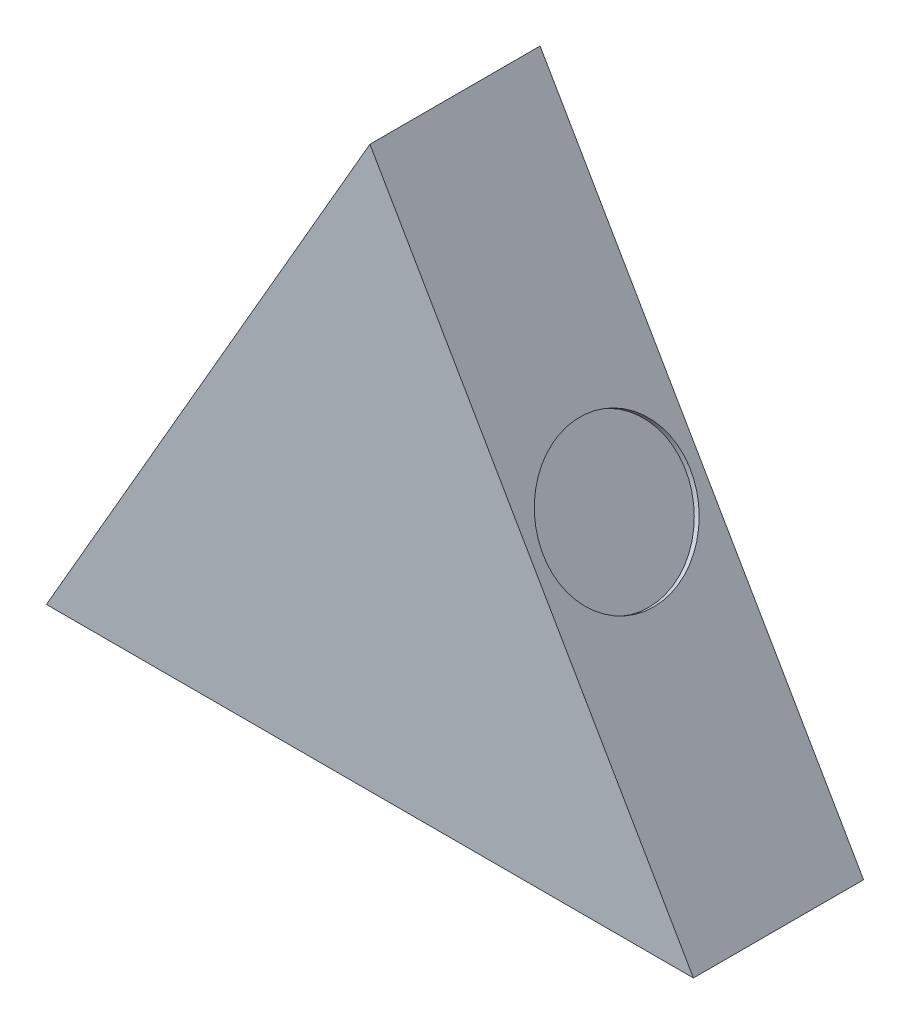
ISO-10303-21;
HEADER;
FILE_DESCRIPTION(('STEP AP214'),'2;1');
FILE_NAME('part.step','',(''),(''),'','','');
FILE_SCHEMA(('AUTOMOTIVE_DESIGN { 1 0 10303 214 1 1 1 1 }'));
ENDSEC;
DATA;
#1=APPLICATION_CONTEXT('core data for automotive mechanical design processes');
#2=APPLICATION_PROTOCOL_DEFINITION('international standard','automotive_design',2000,#1);
#3=PRODUCT_CONTEXT('',#1,'mechanical');
#4=PRODUCT('Part','Part','',(#3));
#5=PRODUCT_RELATED_PRODUCT_CATEGORY('part','',(#4));
#6=PRODUCT_DEFINITION_FORMATION('','',#4);
#7=PRODUCT_DEFINITION_CONTEXT('part definition',#1,'design');
#8=PRODUCT_DEFINITION('design','',#6,#7);
#9=PRODUCT_DEFINITION_SHAPE('','',#8);
#10=(LENGTH_UNIT() NAMED_UNIT(*) SI_UNIT(.MILLI.,.METRE.));
#11=(NAMED_UNIT(*) PLANE_ANGLE_UNIT() SI_UNIT($,.RADIAN.));
#12=(NAMED_UNIT(*) SI_UNIT($,.STERADIAN.) SOLID_ANGLE_UNIT());
#13=UNCERTAINTY_MEASURE_WITH_UNIT(LENGTH_MEASURE(1.E-05),#10,'distance_accuracy_value','');
#14=(GEOMETRIC_REPRESENTATION_CONTEXT(3) GLOBAL_UNCERTAINTY_ASSIGNED_CONTEXT((#13)) GLOBAL_UNIT_ASSIGNED_CONTEXT((#10,
#11,#12)) REPRESENTATION_CONTEXT('',''));
#15=CARTESIAN_POINT('',(0.,0.,0.));
#16=DIRECTION('',(0.,0.,1.));
#17=DIRECTION('',(1.,0.,0.));
#18=AXIS2_PLACEMENT_3D('',#15,#16,#17);
#19=CARTESIAN_POINT('',(0.,0.,0.));
#20=DIRECTION('',(0.,0.,1.));
#21=DIRECTION('',(1.,0.,0.));
#22=AXIS2_PLACEMENT_3D('',#19,#20,#21);
#23=PLANE('',#22);
#24=DIRECTION('',(-0.500000000000001,0.866025403784438,0.));
#25=VECTOR('',#24,1.);
#26=CARTESIAN_POINT('',(28.5177788775064,-24.6971209674279,0.));
#27=LINE('',#26,#25);
#28=CARTESIAN_POINT('',(28.5177788775064,-24.6971209674279,0.));
#29=VERTEX_POINT('',#28);
#30=CARTESIAN_POINT('',(-2.48065457064683E-13,24.6971209674279,0.));
#31=VERTEX_POINT('',#30);
#32=EDGE_CURVE('E172',#29,#31,#27,.T.);
#33=ORIENTED_EDGE('',*,*,#32,.F.);
#34=DIRECTION('',(1.,0.,0.));
#35=VECTOR('',#34,1.);
#36=CARTESIAN_POINT('',(-28.5177788775064,-24.6971209674279,0.));
#37=LINE('',#36,#35);
#38=CARTESIAN_POINT('',(-28.5177788775064,-24.6971209674279,0.));
#39=VERTEX_POINT('',#38);
#40=EDGE_CURVE('E85',#39,#29,#37,.T.);
#41=ORIENTED_EDGE('',*,*,#40,.F.);
#42=DIRECTION('',(-0.499999999999995,-0.866025403784442,0.));
#43=VECTOR('',#42,1.);
#44=CARTESIAN_POINT('',(-2.48065457064683E-13,24.6971209674279,0.));
#45=LINE('',#44,#43);
#46=EDGE_CURVE('E178',#31,#39,#45,.T.);
#47=ORIENTED_EDGE('',*,*,#46,.F.);
#48=EDGE_LOOP('',(#33,#41,#47));
#49=FACE_BOUND('',#48,.T.);
#50=CARTESIAN_POINT('',(0.,6.58100089794191,0.));
#51=DIRECTION('',(0.,0.,1.));
#52=DIRECTION('',(1.,0.,0.));
#53=AXIS2_PLACEMENT_3D('',#50,#51,#52);
#54=CIRCLE('',#53,3.92145220783505);
#55=CARTESIAN_POINT('',(2.37631234562467,9.70044428649156,0.));
#56=VERTEX_POINT('',#55);
#57=CARTESIAN_POINT('',(-2.37631234562468,9.70044428649156,0.));
#58=VERTEX_POINT('',#57);
#59=EDGE_CURVE('E59',#56,#58,#54,.T.);
#60=ORIENTED_EDGE('',*,*,#59,.T.);
#61=DIRECTION('',(-0.976410228367284,-0.215923750291041,0.));
#62=VECTOR('',#61,1.);
#63=CARTESIAN_POINT('',(-2.37631234562468,9.70044428649156,0.));
#64=LINE('',#63,#62);
#65=CARTESIAN_POINT('',(-3.41776144469771,9.47013781419549,0.));
#66=VERTEX_POINT('',#65);
#67=EDGE_CURVE('E170',#58,#66,#64,.T.);
#68=ORIENTED_EDGE('',*,*,#67,.T.);
#69=CARTESIAN_POINT('',(0.,-3.56299926426535,0.));
#70=DIRECTION('',(0.,0.,1.));
#71=DIRECTION('',(1.,0.,0.));
#72=AXIS2_PLACEMENT_3D('',#69,#70,#71);
#73=CIRCLE('',#72,13.4738174026077);
#74=CARTESIAN_POINT('',(-13.4738174026077,-3.56299926426536,0.));
#75=VERTEX_POINT('',#74);
#76=EDGE_CURVE('E278',#66,#75,#73,.T.);
#77=ORIENTED_EDGE('',*,*,#76,.T.);
#78=DIRECTION('',(0.,-1.,0.));
#79=VECTOR('',#78,1.);
#80=CARTESIAN_POINT('',(-13.4738174026077,-3.56299926426536,0.));
#81=LINE('',#80,#79);
#82=CARTESIAN_POINT('',(-13.4738174026077,-20.0629992642654,0.));
#83=VERTEX_POINT('',#82);
#84=EDGE_CURVE('E282',#75,#83,#81,.T.);
#85=ORIENTED_EDGE('',*,*,#84,.T.);
#86=CARTESIAN_POINT('',(-10.,-20.0629992642654,0.));
#87=DIRECTION('',(0.,0.,1.));
#88=DIRECTION('',(1.,0.,0.));
#89=AXIS2_PLACEMENT_3D('',#86,#87,#88);
#90=CIRCLE('',#89,3.47381740260768);
#91=CARTESIAN_POINT('',(-10.,-23.5368166668731,0.));
#92=VERTEX_POINT('',#91);
#93=EDGE_CURVE('E286',#83,#92,#90,.T.);
#94=ORIENTED_EDGE('',*,*,#93,.T.);
#95=DIRECTION('',(1.,0.,0.));
#96=VECTOR('',#95,1.);
#97=CARTESIAN_POINT('',(-10.,-23.5368166668731,0.));
#98=LINE('',#97,#96);
#99=CARTESIAN_POINT('',(10.,-23.536816666873,0.));
#100=VERTEX_POINT('',#99);
#101=EDGE_CURVE('E290',#92,#100,#98,.T.);
#102=ORIENTED_EDGE('',*,*,#101,.T.);
#103=CARTESIAN_POINT('',(10.,-20.0629992642654,0.));
#104=DIRECTION('',(0.,0.,1.));
#105=DIRECTION('',(1.,0.,0.));
#106=AXIS2_PLACEMENT_3D('',#103,#104,#105);
#107=CIRCLE('',#106,3.47381740260768);
#108=CARTESIAN_POINT('',(13.4738174026077,-20.0629992642654,0.));
#109=VERTEX_POINT('',#108);
#110=EDGE_CURVE('E294',#100,#109,#107,.T.);
#111=ORIENTED_EDGE('',*,*,#110,.T.);
#112=DIRECTION('',(0.,1.,0.));
#113=VECTOR('',#112,1.);
#114=CARTESIAN_POINT('',(13.4738174026077,-3.56299926426536,0.));
#115=LINE('',#114,#113);
#116=CARTESIAN_POINT('',(13.4738174026077,-3.56299926426535,0.));
#117=VERTEX_POINT('',#116);
#118=EDGE_CURVE('E298',#109,#117,#115,.T.);
#119=ORIENTED_EDGE('',*,*,#118,.T.);
#120=CARTESIAN_POINT('',(0.,-3.56299926426535,0.));
#121=DIRECTION('',(0.,0.,1.));
#122=DIRECTION('',(1.,0.,0.));
#123=AXIS2_PLACEMENT_3D('',#120,#121,#122);
#124=CIRCLE('',#123,13.4738174026077);
#125=CARTESIAN_POINT('',(3.41776144469768,9.4701378141955,0.));
#126=VERTEX_POINT('',#125);
#127=EDGE_CURVE('E302',#117,#126,#124,.T.);
#128=ORIENTED_EDGE('',*,*,#127,.T.);
#129=DIRECTION('',(-0.976410228367284,0.215923750291041,0.));
#130=VECTOR('',#129,1.);
#131=CARTESIAN_POINT('',(2.37631234562467,9.70044428649157,0.));
#132=LINE('',#131,#130);
#133=EDGE_CURVE('E166',#126,#56,#132,.T.);
#134=ORIENTED_EDGE('',*,*,#133,.T.);
#135=EDGE_LOOP('',(#60,#68,#77,#85,#94,#102,#111,#119,#128,#134));
#136=FACE_BOUND('',#135,.T.);
#137=ADVANCED_FACE('F43',(#49,#136),#23,.F.);
#138=CARTESIAN_POINT('',(28.5177788775064,-24.6971209674279,15.));
#139=DIRECTION('',(-0.866025403784438,-0.500000000000001,0.));
#140=DIRECTION('',(0.500000000000001,-0.866025403784438,0.));
#141=AXIS2_PLACEMENT_3D('',#138,#139,#140);
#142=PLANE('',#141);
#143=CARTESIAN_POINT('',(14.2588894387531,-1.5292080969564E-13,7.5));
#144=DIRECTION('',(-0.866025403784438,-0.500000000000001,0.));
#145=DIRECTION('',(0.500000000000001,-0.866025403784438,0.));
#146=AXIS2_PLACEMENT_3D('',#143,#144,#145);
#147=CIRCLE('',#146,6.5);
#148=CARTESIAN_POINT('',(17.5088894387532,-5.629165124599,7.5));
#149=VERTEX_POINT('',#148);
#150=EDGE_CURVE('E240',#149,#149,#147,.T.);
#151=ORIENTED_EDGE('',*,*,#150,.T.);
#152=EDGE_LOOP('',(#151));
#153=FACE_BOUND('',#152,.T.);
#154=ORIENTED_EDGE('',*,*,#32,.T.);
#155=DIRECTION('',(0.,0.,-1.));
#156=VECTOR('',#155,1.);
#157=CARTESIAN_POINT('',(-2.48065457064683E-13,24.6971209674279,15.));
#158=LINE('',#157,#156);
#159=CARTESIAN_POINT('',(-2.48065457064683E-13,24.6971209674279,15.));
#160=VERTEX_POINT('',#159);
#161=EDGE_CURVE('E11',#160,#31,#158,.T.);
#162=ORIENTED_EDGE('',*,*,#161,.F.);
#163=DIRECTION('',(-0.500000000000001,0.866025403784438,0.));
#164=VECTOR('',#163,1.);
#165=CARTESIAN_POINT('',(28.5177788775064,-24.6971209674279,15.));
#166=LINE('',#165,#164);
#167=CARTESIAN_POINT('',(28.5177788775064,-24.6971209674279,15.));
#168=VERTEX_POINT('',#167);
#169=EDGE_CURVE('E184',#168,#160,#166,.T.);
#170=ORIENTED_EDGE('',*,*,#169,.F.);
#171=DIRECTION('',(0.,0.,-1.));
#172=VECTOR('',#171,1.);
#173=CARTESIAN_POINT('',(28.5177788775064,-24.6971209674279,15.));
#174=LINE('',#173,#172);
#175=EDGE_CURVE('E190',#168,#29,#174,.T.);
#176=ORIENTED_EDGE('',*,*,#175,.T.);
#177=EDGE_LOOP('',(#154,#162,#170,#176));
#178=FACE_BOUND('',#177,.T.);
#179=ADVANCED_FACE('F45',(#153,#178),#142,.F.);
#180=CARTESIAN_POINT('',(-2.48065457064683E-13,24.6971209674279,15.));
#181=DIRECTION('',(0.866025403784442,-0.499999999999995,0.));
#182=DIRECTION('',(0.499999999999995,0.866025403784442,0.));
#183=AXIS2_PLACEMENT_3D('',#180,#181,#182);
#184=PLANE('',#183);
#185=CARTESIAN_POINT('',(-14.2588894387533,0.,7.5));
#186=DIRECTION('',(0.866025403784442,-0.499999999999995,0.));
#187=DIRECTION('',(0.499999999999995,0.866025403784442,0.));
#188=AXIS2_PLACEMENT_3D('',#185,#186,#187);
#189=CIRCLE('',#188,6.5);
#190=CARTESIAN_POINT('',(-11.0088894387534,5.62916512459883,7.5));
#191=VERTEX_POINT('',#190);
#192=EDGE_CURVE('E228',#191,#191,#189,.T.);
#193=ORIENTED_EDGE('',*,*,#192,.T.);
#194=EDGE_LOOP('',(#193));
#195=FACE_BOUND('',#194,.T.);
#196=ORIENTED_EDGE('',*,*,#46,.T.);
#197=DIRECTION('',(0.,0.,-1.));
#198=VECTOR('',#197,1.);
#199=CARTESIAN_POINT('',(-28.5177788775064,-24.6971209674279,15.));
#200=LINE('',#199,#198);
#201=CARTESIAN_POINT('',(-28.5177788775064,-24.6971209674279,15.));
#202=VERTEX_POINT('',#201);
#203=EDGE_CURVE('E52',#202,#39,#200,.T.);
#204=ORIENTED_EDGE('',*,*,#203,.F.);
#205=DIRECTION('',(-0.499999999999995,-0.866025403784442,0.));
#206=VECTOR('',#205,1.);
#207=CARTESIAN_POINT('',(-2.48065457064683E-13,24.6971209674279,15.));
#208=LINE('',#207,#206);
#209=EDGE_CURVE('E90',#160,#202,#208,.T.);
#210=ORIENTED_EDGE('',*,*,#209,.F.);
#211=ORIENTED_EDGE('',*,*,#161,.T.);
#212=EDGE_LOOP('',(#196,#204,#210,#211));
#213=FACE_BOUND('',#212,.T.);
#214=ADVANCED_FACE('F213',(#195,#213),#184,.F.);
#215=CARTESIAN_POINT('',(-28.5177788775064,-24.6971209674279,15.));
#216=DIRECTION('',(0.,1.,0.));
#217=DIRECTION('',(0.,0.,1.));
#218=AXIS2_PLACEMENT_3D('',#215,#216,#217);
#219=PLANE('',#218);
#220=CARTESIAN_POINT('',(0.,-24.6971209674279,7.5));
#221=DIRECTION('',(0.,-1.,0.));
#222=DIRECTION('',(0.,0.,-1.));
#223=AXIS2_PLACEMENT_3D('',#220,#221,#222);
#224=CIRCLE('',#223,6.5);
#225=CARTESIAN_POINT('',(0.,-24.6971209674279,0.999999999999999));
#226=VERTEX_POINT('',#225);
#227=EDGE_CURVE('E237',#226,#226,#224,.T.);
#228=ORIENTED_EDGE('',*,*,#227,.F.);
#229=EDGE_LOOP('',(#228));
#230=FACE_BOUND('',#229,.T.);
#231=ORIENTED_EDGE('',*,*,#40,.T.);
#232=ORIENTED_EDGE('',*,*,#175,.F.);
#233=DIRECTION('',(1.,0.,0.));
#234=VECTOR('',#233,1.);
#235=CARTESIAN_POINT('',(-28.5177788775064,-24.6971209674279,15.));
#236=LINE('',#235,#234);
#237=EDGE_CURVE('E68',#202,#168,#236,.T.);
#238=ORIENTED_EDGE('',*,*,#237,.F.);
#239=ORIENTED_EDGE('',*,*,#203,.T.);
#240=EDGE_LOOP('',(#231,#232,#238,#239));
#241=FACE_BOUND('',#240,.T.);
#242=ADVANCED_FACE('F198',(#230,#241),#219,.F.);
#243=CARTESIAN_POINT('',(0.,0.,15.));
#244=DIRECTION('',(0.,0.,1.));
#245=DIRECTION('',(1.,0.,0.));
#246=AXIS2_PLACEMENT_3D('',#243,#244,#245);
#247=PLANE('',#246);
#248=ORIENTED_EDGE('',*,*,#169,.T.);
#249=ORIENTED_EDGE('',*,*,#209,.T.);
#250=ORIENTED_EDGE('',*,*,#237,.T.);
#251=EDGE_LOOP('',(#248,#249,#250));
#252=FACE_BOUND('',#251,.T.);
#253=ADVANCED_FACE('F205',(#252),#247,.T.);
#254=CARTESIAN_POINT('',(0.,6.58100089794191,13.));
#255=DIRECTION('',(0.,0.,-1.));
#256=DIRECTION('',(-1.,0.,0.));
#257=AXIS2_PLACEMENT_3D('',#254,#255,#256);
#258=CYLINDRICAL_SURFACE('',#257,3.92145220783505);
#259=ORIENTED_EDGE('',*,*,#59,.F.);
#260=DIRECTION('',(0.,0.,-1.));
#261=VECTOR('',#260,1.);
#262=CARTESIAN_POINT('',(2.37631234562467,9.70044428649157,13.));
#263=LINE('',#262,#261);
#264=CARTESIAN_POINT('',(2.37631234562467,9.70044428649157,13.));
#265=VERTEX_POINT('',#264);
#266=EDGE_CURVE('E164',#265,#56,#263,.T.);
#267=ORIENTED_EDGE('',*,*,#266,.F.);
#268=CARTESIAN_POINT('',(0.,6.58100089794191,13.));
#269=DIRECTION('',(0.,0.,1.));
#270=DIRECTION('',(1.,0.,0.));
#271=AXIS2_PLACEMENT_3D('',#268,#269,#270);
#272=CIRCLE('',#271,3.92145220783505);
#273=CARTESIAN_POINT('',(-2.37631234562468,9.70044428649156,13.));
#274=VERTEX_POINT('',#273);
#275=EDGE_CURVE('E154',#265,#274,#272,.T.);
#276=ORIENTED_EDGE('',*,*,#275,.T.);
#277=DIRECTION('',(0.,0.,-1.));
#278=VECTOR('',#277,1.);
#279=CARTESIAN_POINT('',(-2.37631234562468,9.70044428649156,13.));
#280=LINE('',#279,#278);
#281=EDGE_CURVE('E163',#274,#58,#280,.T.);
#282=ORIENTED_EDGE('',*,*,#281,.T.);
#283=EDGE_LOOP('',(#259,#267,#276,#282));
#284=FACE_BOUND('',#283,.T.);
#285=ADVANCED_FACE('F162',(#284),#258,.F.);
#286=CARTESIAN_POINT('',(-2.37631234562468,9.70044428649156,13.));
#287=DIRECTION('',(0.215923750291041,-0.976410228367284,0.));
#288=DIRECTION('',(0.976410228367284,0.215923750291041,0.));
#289=AXIS2_PLACEMENT_3D('',#286,#287,#288);
#290=PLANE('',#289);
#291=ORIENTED_EDGE('',*,*,#67,.F.);
#292=ORIENTED_EDGE('',*,*,#281,.F.);
#293=DIRECTION('',(-0.976410228367284,-0.215923750291041,0.));
#294=VECTOR('',#293,1.);
#295=CARTESIAN_POINT('',(-2.37631234562468,9.70044428649156,13.));
#296=LINE('',#295,#294);
#297=CARTESIAN_POINT('',(-3.41776144469771,9.47013781419549,13.));
#298=VERTEX_POINT('',#297);
#299=EDGE_CURVE('E150',#274,#298,#296,.T.);
#300=ORIENTED_EDGE('',*,*,#299,.T.);
#301=DIRECTION('',(0.,0.,-1.));
#302=VECTOR('',#301,1.);
#303=CARTESIAN_POINT('',(-3.41776144469771,9.47013781419549,13.));
#304=LINE('',#303,#302);
#305=EDGE_CURVE('E173',#298,#66,#304,.T.);
#306=ORIENTED_EDGE('',*,*,#305,.T.);
#307=EDGE_LOOP('',(#291,#292,#300,#306));
#308=FACE_BOUND('',#307,.T.);
#309=ADVANCED_FACE('F168',(#308),#290,.T.);
#310=CARTESIAN_POINT('',(0.,-3.56299926426535,13.));
#311=DIRECTION('',(0.,0.,-1.));
#312=DIRECTION('',(-1.,0.,0.));
#313=AXIS2_PLACEMENT_3D('',#310,#311,#312);
#314=CYLINDRICAL_SURFACE('',#313,13.4738174026077);
#315=ORIENTED_EDGE('',*,*,#76,.F.);
#316=ORIENTED_EDGE('',*,*,#305,.F.);
#317=CARTESIAN_POINT('',(0.,-3.56299926426535,13.));
#318=DIRECTION('',(0.,0.,1.));
#319=DIRECTION('',(1.,0.,0.));
#320=AXIS2_PLACEMENT_3D('',#317,#318,#319);
#321=CIRCLE('',#320,13.4738174026077);
#322=CARTESIAN_POINT('',(-13.4738174026077,-3.56299926426536,13.));
#323=VERTEX_POINT('',#322);
#324=EDGE_CURVE('E156',#298,#323,#321,.T.);
#325=ORIENTED_EDGE('',*,*,#324,.T.);
#326=DIRECTION('',(0.,0.,-1.));
#327=VECTOR('',#326,1.);
#328=CARTESIAN_POINT('',(-13.4738174026077,-3.56299926426536,13.));
#329=LINE('',#328,#327);
#330=EDGE_CURVE('E180',#323,#75,#329,.T.);
#331=ORIENTED_EDGE('',*,*,#330,.T.);
#332=EDGE_LOOP('',(#315,#316,#325,#331));
#333=FACE_BOUND('',#332,.T.);
#334=ADVANCED_FACE('F333',(#333),#314,.F.);
#335=CARTESIAN_POINT('',(-13.4738174026077,-3.56299926426536,13.));
#336=DIRECTION('',(1.,0.,0.));
#337=DIRECTION('',(0.,0.,-1.));
#338=AXIS2_PLACEMENT_3D('',#335,#336,#337);
#339=PLANE('',#338);
#340=ORIENTED_EDGE('',*,*,#84,.F.);
#341=ORIENTED_EDGE('',*,*,#330,.F.);
#342=DIRECTION('',(0.,-1.,0.));
#343=VECTOR('',#342,1.);
#344=CARTESIAN_POINT('',(-13.4738174026077,-3.56299926426536,13.));
#345=LINE('',#344,#343);
#346=CARTESIAN_POINT('',(-13.4738174026077,-20.0629992642654,13.));
#347=VERTEX_POINT('',#346);
#348=EDGE_CURVE('E253',#323,#347,#345,.T.);
#349=ORIENTED_EDGE('',*,*,#348,.T.);
#350=DIRECTION('',(0.,0.,-1.));
#351=VECTOR('',#350,1.);
#352=CARTESIAN_POINT('',(-13.4738174026077,-20.0629992642654,13.));
#353=LINE('',#352,#351);
#354=EDGE_CURVE('E326',#347,#83,#353,.T.);
#355=ORIENTED_EDGE('',*,*,#354,.T.);
#356=EDGE_LOOP('',(#340,#341,#349,#355));
#357=FACE_BOUND('',#356,.T.);
#358=ADVANCED_FACE('F335',(#357),#339,.T.);
#359=CARTESIAN_POINT('',(-10.,-20.0629992642654,13.));
#360=DIRECTION('',(0.,0.,-1.));
#361=DIRECTION('',(-1.,0.,0.));
#362=AXIS2_PLACEMENT_3D('',#359,#360,#361);
#363=CYLINDRICAL_SURFACE('',#362,3.47381740260768);
#364=ORIENTED_EDGE('',*,*,#93,.F.);
#365=ORIENTED_EDGE('',*,*,#354,.F.);
#366=CARTESIAN_POINT('',(-10.,-20.0629992642654,13.));
#367=DIRECTION('',(0.,0.,1.));
#368=DIRECTION('',(1.,0.,0.));
#369=AXIS2_PLACEMENT_3D('',#366,#367,#368);
#370=CIRCLE('',#369,3.47381740260768);
#371=CARTESIAN_POINT('',(-10.,-23.5368166668731,13.));
#372=VERTEX_POINT('',#371);
#373=EDGE_CURVE('E256',#347,#372,#370,.T.);
#374=ORIENTED_EDGE('',*,*,#373,.T.);
#375=DIRECTION('',(0.,0.,-1.));
#376=VECTOR('',#375,1.);
#377=CARTESIAN_POINT('',(-10.,-23.5368166668731,13.));
#378=LINE('',#377,#376);
#379=EDGE_CURVE('E323',#372,#92,#378,.T.);
#380=ORIENTED_EDGE('',*,*,#379,.T.);
#381=EDGE_LOOP('',(#364,#365,#374,#380));
#382=FACE_BOUND('',#381,.T.);
#383=ADVANCED_FACE('F364',(#382),#363,.F.);
#384=CARTESIAN_POINT('',(-10.,-23.5368166668731,13.));
#385=DIRECTION('',(0.,1.,0.));
#386=DIRECTION('',(0.,0.,1.));
#387=AXIS2_PLACEMENT_3D('',#384,#385,#386);
#388=PLANE('',#387);
#389=ORIENTED_EDGE('',*,*,#101,.F.);
#390=ORIENTED_EDGE('',*,*,#379,.F.);
#391=DIRECTION('',(1.,0.,0.));
#392=VECTOR('',#391,1.);
#393=CARTESIAN_POINT('',(-10.,-23.5368166668731,13.));
#394=LINE('',#393,#392);
#395=CARTESIAN_POINT('',(10.,-23.536816666873,13.));
#396=VERTEX_POINT('',#395);
#397=EDGE_CURVE('E259',#372,#396,#394,.T.);
#398=ORIENTED_EDGE('',*,*,#397,.T.);
#399=DIRECTION('',(0.,0.,-1.));
#400=VECTOR('',#399,1.);
#401=CARTESIAN_POINT('',(10.,-23.536816666873,13.));
#402=LINE('',#401,#400);
#403=EDGE_CURVE('E320',#396,#100,#402,.T.);
#404=ORIENTED_EDGE('',*,*,#403,.T.);
#405=EDGE_LOOP('',(#389,#390,#398,#404));
#406=FACE_BOUND('',#405,.T.);
#407=ADVANCED_FACE('F362',(#406),#388,.T.);
#408=CARTESIAN_POINT('',(10.,-20.0629992642654,13.));
#409=DIRECTION('',(0.,0.,-1.));
#410=DIRECTION('',(-1.,0.,0.));
#411=AXIS2_PLACEMENT_3D('',#408,#409,#410);
#412=CYLINDRICAL_SURFACE('',#411,3.47381740260768);
#413=ORIENTED_EDGE('',*,*,#110,.F.);
#414=ORIENTED_EDGE('',*,*,#403,.F.);
#415=CARTESIAN_POINT('',(10.,-20.0629992642654,13.));
#416=DIRECTION('',(0.,0.,1.));
#417=DIRECTION('',(1.,0.,0.));
#418=AXIS2_PLACEMENT_3D('',#415,#416,#417);
#419=CIRCLE('',#418,3.47381740260768);
#420=CARTESIAN_POINT('',(13.4738174026077,-20.0629992642654,13.));
#421=VERTEX_POINT('',#420);
#422=EDGE_CURVE('E262',#396,#421,#419,.T.);
#423=ORIENTED_EDGE('',*,*,#422,.T.);
#424=DIRECTION('',(0.,0.,-1.));
#425=VECTOR('',#424,1.);
#426=CARTESIAN_POINT('',(13.4738174026077,-20.0629992642654,13.));
#427=LINE('',#426,#425);
#428=EDGE_CURVE('E317',#421,#109,#427,.T.);
#429=ORIENTED_EDGE('',*,*,#428,.T.);
#430=EDGE_LOOP('',(#413,#414,#423,#429));
#431=FACE_BOUND('',#430,.T.);
#432=ADVANCED_FACE('F355',(#431),#412,.F.);
#433=CARTESIAN_POINT('',(13.4738174026077,-3.56299926426536,13.));
#434=DIRECTION('',(-1.,0.,0.));
#435=DIRECTION('',(0.,0.,1.));
#436=AXIS2_PLACEMENT_3D('',#433,#434,#435);
#437=PLANE('',#436);
#438=ORIENTED_EDGE('',*,*,#118,.F.);
#439=ORIENTED_EDGE('',*,*,#428,.F.);
#440=DIRECTION('',(0.,1.,0.));
#441=VECTOR('',#440,1.);
#442=CARTESIAN_POINT('',(13.4738174026077,-3.56299926426536,13.));
#443=LINE('',#442,#441);
#444=CARTESIAN_POINT('',(13.4738174026077,-3.56299926426535,13.));
#445=VERTEX_POINT('',#444);
#446=EDGE_CURVE('E265',#421,#445,#443,.T.);
#447=ORIENTED_EDGE('',*,*,#446,.T.);
#448=DIRECTION('',(0.,0.,-1.));
#449=VECTOR('',#448,1.);
#450=CARTESIAN_POINT('',(13.4738174026077,-3.56299926426535,13.));
#451=LINE('',#450,#449);
#452=EDGE_CURVE('E314',#445,#117,#451,.T.);
#453=ORIENTED_EDGE('',*,*,#452,.T.);
#454=EDGE_LOOP('',(#438,#439,#447,#453));
#455=FACE_BOUND('',#454,.T.);
#456=ADVANCED_FACE('F351',(#455),#437,.T.);
#457=CARTESIAN_POINT('',(0.,-3.56299926426535,13.));
#458=DIRECTION('',(0.,0.,-1.));
#459=DIRECTION('',(-1.,0.,0.));
#460=AXIS2_PLACEMENT_3D('',#457,#458,#459);
#461=CYLINDRICAL_SURFACE('',#460,13.4738174026077);
#462=ORIENTED_EDGE('',*,*,#127,.F.);
#463=ORIENTED_EDGE('',*,*,#452,.F.);
#464=CARTESIAN_POINT('',(0.,-3.56299926426535,13.));
#465=DIRECTION('',(0.,0.,1.));
#466=DIRECTION('',(1.,0.,0.));
#467=AXIS2_PLACEMENT_3D('',#464,#465,#466);
#468=CIRCLE('',#467,13.4738174026077);
#469=CARTESIAN_POINT('',(3.41776144469768,9.4701378141955,13.));
#470=VERTEX_POINT('',#469);
#471=EDGE_CURVE('E268',#445,#470,#468,.T.);
#472=ORIENTED_EDGE('',*,*,#471,.T.);
#473=DIRECTION('',(0.,0.,-1.));
#474=VECTOR('',#473,1.);
#475=CARTESIAN_POINT('',(3.41776144469768,9.4701378141955,13.));
#476=LINE('',#475,#474);
#477=EDGE_CURVE('E311',#470,#126,#476,.T.);
#478=ORIENTED_EDGE('',*,*,#477,.T.);
#479=EDGE_LOOP('',(#462,#463,#472,#478));
#480=FACE_BOUND('',#479,.T.);
#481=ADVANCED_FACE('F348',(#480),#461,.F.);
#482=CARTESIAN_POINT('',(2.37631234562467,9.70044428649157,13.));
#483=DIRECTION('',(-0.215923750291041,-0.976410228367284,0.));
#484=DIRECTION('',(0.976410228367285,-0.215923750291041,0.));
#485=AXIS2_PLACEMENT_3D('',#482,#483,#484);
#486=PLANE('',#485);
#487=ORIENTED_EDGE('',*,*,#133,.F.);
#488=ORIENTED_EDGE('',*,*,#477,.F.);
#489=DIRECTION('',(-0.976410228367284,0.215923750291041,0.));
#490=VECTOR('',#489,1.);
#491=CARTESIAN_POINT('',(2.37631234562467,9.70044428649157,13.));
#492=LINE('',#491,#490);
#493=EDGE_CURVE('E271',#470,#265,#492,.T.);
#494=ORIENTED_EDGE('',*,*,#493,.T.);
#495=ORIENTED_EDGE('',*,*,#266,.T.);
#496=EDGE_LOOP('',(#487,#488,#494,#495));
#497=FACE_BOUND('',#496,.T.);
#498=ADVANCED_FACE('F342',(#497),#486,.T.);
#499=CARTESIAN_POINT('',(0.,6.58100089794191,13.));
#500=DIRECTION('',(0.,0.,1.));
#501=DIRECTION('',(1.,0.,0.));
#502=AXIS2_PLACEMENT_3D('',#499,#500,#501);
#503=PLANE('',#502);
#504=ORIENTED_EDGE('',*,*,#275,.F.);
#505=ORIENTED_EDGE('',*,*,#493,.F.);
#506=ORIENTED_EDGE('',*,*,#471,.F.);
#507=ORIENTED_EDGE('',*,*,#446,.F.);
#508=ORIENTED_EDGE('',*,*,#422,.F.);
#509=ORIENTED_EDGE('',*,*,#397,.F.);
#510=ORIENTED_EDGE('',*,*,#373,.F.);
#511=ORIENTED_EDGE('',*,*,#348,.F.);
#512=ORIENTED_EDGE('',*,*,#324,.F.);
#513=ORIENTED_EDGE('',*,*,#299,.F.);
#514=EDGE_LOOP('',(#504,#505,#506,#507,#508,#509,#510,#511,#512,#513));
#515=FACE_BOUND('',#514,.T.);
#516=ADVANCED_FACE('F152',(#515),#503,.F.);
#517=CARTESIAN_POINT('',(0.,-24.1971209674279,7.5));
#518=DIRECTION('',(0.,-1.,0.));
#519=DIRECTION('',(0.,0.,-1.));
#520=AXIS2_PLACEMENT_3D('',#517,#518,#519);
#521=CYLINDRICAL_SURFACE('',#520,6.5);
#522=CARTESIAN_POINT('',(0.,-24.1971209674279,7.5));
#523=DIRECTION('',(0.,-1.,0.));
#524=DIRECTION('',(0.,0.,-1.));
#525=AXIS2_PLACEMENT_3D('',#522,#523,#524);
#526=CIRCLE('',#525,6.5);
#527=CARTESIAN_POINT('',(0.,-24.1971209674279,0.999999999999999));
#528=VERTEX_POINT('',#527);
#529=EDGE_CURVE('E244',#528,#528,#526,.T.);
#530=ORIENTED_EDGE('',*,*,#529,.F.);
#531=EDGE_LOOP('',(#530));
#532=FACE_BOUND('',#531,.T.);
#533=ORIENTED_EDGE('',*,*,#227,.T.);
#534=EDGE_LOOP('',(#533));
#535=FACE_BOUND('',#534,.T.);
#536=ADVANCED_FACE('F447',(#532,#535),#521,.F.);
#537=CARTESIAN_POINT('',(0.,-24.1971209674279,7.5));
#538=DIRECTION('',(0.,-1.,0.));
#539=DIRECTION('',(0.,0.,-1.));
#540=AXIS2_PLACEMENT_3D('',#537,#538,#539);
#541=PLANE('',#540);
#542=ORIENTED_EDGE('',*,*,#529,.T.);
#543=EDGE_LOOP('',(#542));
#544=FACE_BOUND('',#543,.T.);
#545=ADVANCED_FACE('F466',(#544),#541,.T.);
#546=CARTESIAN_POINT('',(-13.8258767368611,-0.250000000000035,7.5));
#547=DIRECTION('',(-0.866025403784442,0.499999999999995,0.));
#548=DIRECTION('',(-0.499999999999995,-0.866025403784442,0.));
#549=AXIS2_PLACEMENT_3D('',#546,#547,#548);
#550=CYLINDRICAL_SURFACE('',#549,6.5);
#551=CARTESIAN_POINT('',(-13.8258767368611,-0.250000000000035,7.5));
#552=DIRECTION('',(0.866025403784442,-0.499999999999995,0.));
#553=DIRECTION('',(0.499999999999995,0.866025403784442,0.));
#554=AXIS2_PLACEMENT_3D('',#551,#552,#553);
#555=CIRCLE('',#554,6.5);
#556=CARTESIAN_POINT('',(-10.5758767368611,5.37916512459884,7.5));
#557=VERTEX_POINT('',#556);
#558=EDGE_CURVE('E231',#557,#557,#555,.T.);
#559=ORIENTED_EDGE('',*,*,#558,.T.);
#560=EDGE_LOOP('',(#559));
#561=FACE_BOUND('',#560,.T.);
#562=ORIENTED_EDGE('',*,*,#192,.F.);
#563=EDGE_LOOP('',(#562));
#564=FACE_BOUND('',#563,.T.);
#565=ADVANCED_FACE('F476',(#561,#564),#550,.F.);
#566=CARTESIAN_POINT('',(-13.8258767368611,-0.250000000000035,7.5));
#567=DIRECTION('',(0.866025403784442,-0.499999999999995,0.));
#568=DIRECTION('',(0.499999999999995,0.866025403784442,0.));
#569=AXIS2_PLACEMENT_3D('',#566,#567,#568);
#570=PLANE('',#569);
#571=ORIENTED_EDGE('',*,*,#558,.F.);
#572=EDGE_LOOP('',(#571));
#573=FACE_BOUND('',#572,.T.);
#574=ADVANCED_FACE('F493',(#573),#570,.F.);
#575=CARTESIAN_POINT('',(13.8258767368609,-0.250000000000154,7.5));
#576=DIRECTION('',(0.866025403784438,0.500000000000001,0.));
#577=DIRECTION('',(-0.500000000000001,0.866025403784438,0.));
#578=AXIS2_PLACEMENT_3D('',#575,#576,#577);
#579=CYLINDRICAL_SURFACE('',#578,6.5);
#580=CARTESIAN_POINT('',(13.8258767368609,-0.250000000000154,7.5));
#581=DIRECTION('',(-0.866025403784438,-0.500000000000001,0.));
#582=DIRECTION('',(0.500000000000001,-0.866025403784438,0.));
#583=AXIS2_PLACEMENT_3D('',#580,#581,#582);
#584=CIRCLE('',#583,6.5);
#585=CARTESIAN_POINT('',(17.0758767368609,-5.879165124599,7.5));
#586=VERTEX_POINT('',#585);
#587=EDGE_CURVE('E232',#586,#586,#584,.T.);
#588=ORIENTED_EDGE('',*,*,#587,.T.);
#589=EDGE_LOOP('',(#588));
#590=FACE_BOUND('',#589,.T.);
#591=ORIENTED_EDGE('',*,*,#150,.F.);
#592=EDGE_LOOP('',(#591));
#593=FACE_BOUND('',#592,.T.);
#594=ADVANCED_FACE('F504',(#590,#593),#579,.F.);
#595=CARTESIAN_POINT('',(13.8258767368609,-0.250000000000154,7.5));
#596=DIRECTION('',(-0.866025403784438,-0.500000000000001,0.));
#597=DIRECTION('',(0.500000000000001,-0.866025403784438,0.));
#598=AXIS2_PLACEMENT_3D('',#595,#596,#597);
#599=PLANE('',#598);
#600=ORIENTED_EDGE('',*,*,#587,.F.);
#601=EDGE_LOOP('',(#600));
#602=FACE_BOUND('',#601,.T.);
#603=ADVANCED_FACE('F521',(#602),#599,.F.);
#604=CLOSED_SHELL('',(#137,#179,#214,#242,#253,#285,#309,#334,#358,#383,#407,#432,#456,#481,
#498,#516,#536,#545,#565,#574,#594,#603));
#605=MANIFOLD_SOLID_BREP('B2',#604);
#606=ADVANCED_BREP_SHAPE_REPRESENTATION('',(#18,#605),#14);
#607=SHAPE_DEFINITION_REPRESENTATION(#9,#606);
ENDSEC;
END-ISO-10303-21;
